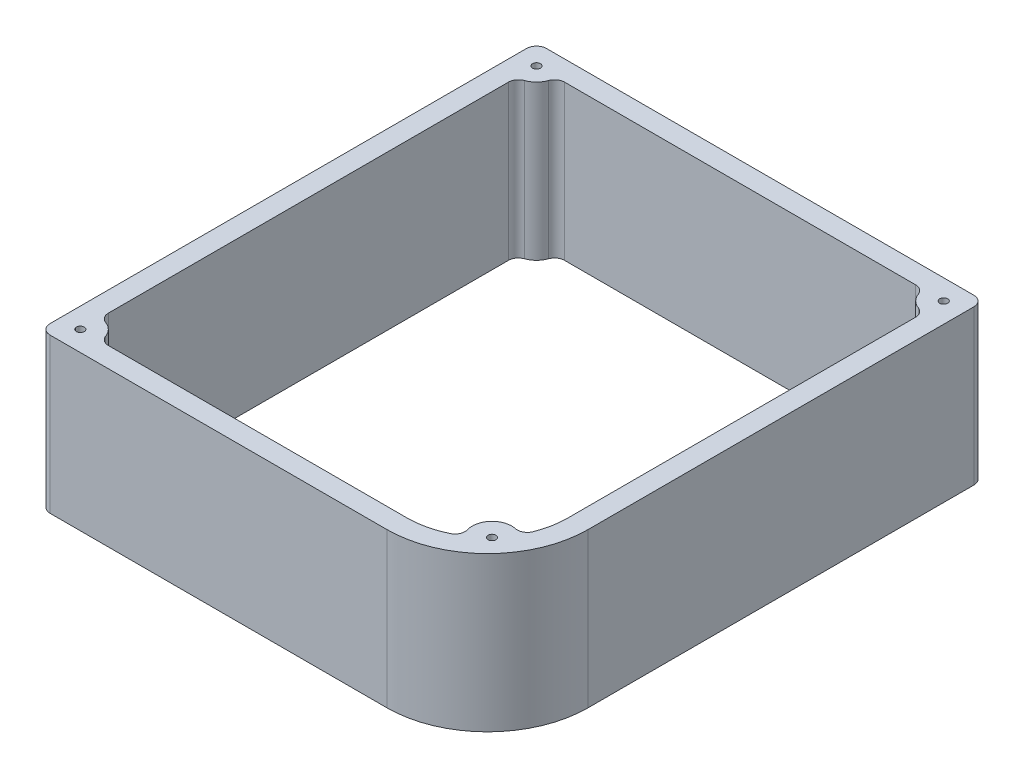
ISO-10303-21;
HEADER;
FILE_DESCRIPTION(('STEP AP214'),'2;1');
FILE_NAME('part.step','',(''),(''),'','','');
FILE_SCHEMA(('AUTOMOTIVE_DESIGN { 1 0 10303 214 1 1 1 1 }'));
ENDSEC;
DATA;
#1=APPLICATION_CONTEXT('core data for automotive mechanical design processes');
#2=APPLICATION_PROTOCOL_DEFINITION('international standard','automotive_design',2000,#1);
#3=PRODUCT_CONTEXT('',#1,'mechanical');
#4=PRODUCT('Part','Part','',(#3));
#5=PRODUCT_RELATED_PRODUCT_CATEGORY('part','',(#4));
#6=PRODUCT_DEFINITION_FORMATION('','',#4);
#7=PRODUCT_DEFINITION_CONTEXT('part definition',#1,'design');
#8=PRODUCT_DEFINITION('design','',#6,#7);
#9=PRODUCT_DEFINITION_SHAPE('','',#8);
#10=(LENGTH_UNIT() NAMED_UNIT(*) SI_UNIT(.MILLI.,.METRE.));
#11=(NAMED_UNIT(*) PLANE_ANGLE_UNIT() SI_UNIT($,.RADIAN.));
#12=(NAMED_UNIT(*) SI_UNIT($,.STERADIAN.) SOLID_ANGLE_UNIT());
#13=UNCERTAINTY_MEASURE_WITH_UNIT(LENGTH_MEASURE(1.E-05),#10,'distance_accuracy_value','');
#14=(GEOMETRIC_REPRESENTATION_CONTEXT(3) GLOBAL_UNCERTAINTY_ASSIGNED_CONTEXT((#13)) GLOBAL_UNIT_ASSIGNED_CONTEXT((#10,
#11,#12)) REPRESENTATION_CONTEXT('',''));
#15=CARTESIAN_POINT('',(0.,0.,0.));
#16=DIRECTION('',(0.,0.,1.));
#17=DIRECTION('',(1.,0.,0.));
#18=AXIS2_PLACEMENT_3D('',#15,#16,#17);
#19=CARTESIAN_POINT('',(22.8844907346791,39.,46.8900761871675));
#20=DIRECTION('',(0.,1.,0.));
#21=DIRECTION('',(0.,0.,1.));
#22=AXIS2_PLACEMENT_3D('',#19,#20,#21);
#23=PLANE('',#22);
#24=CARTESIAN_POINT('',(-59.6555092853209,39.,67.2100761871675));
#25=DIRECTION('',(0.,1.,0.));
#26=DIRECTION('',(0.,0.,1.));
#27=AXIS2_PLACEMENT_3D('',#24,#25,#26);
#28=CIRCLE('',#27,0.999999999999998);
#29=CARTESIAN_POINT('',(-59.6555092853209,39.,68.2100761871675));
#30=VERTEX_POINT('',#29);
#31=EDGE_CURVE('E455',#30,#30,#28,.T.);
#32=ORIENTED_EDGE('',*,*,#31,.F.);
#33=EDGE_LOOP('',(#32));
#34=FACE_BOUND('',#33,.T.);
#35=CARTESIAN_POINT('',(-59.6555092853209,39.,-48.0299778128325));
#36=DIRECTION('',(0.,1.,0.));
#37=DIRECTION('',(0.,0.,1.));
#38=AXIS2_PLACEMENT_3D('',#35,#36,#37);
#39=CIRCLE('',#38,0.999999999999998);
#40=CARTESIAN_POINT('',(-59.6555092853209,39.,-47.0299778128325));
#41=VERTEX_POINT('',#40);
#42=EDGE_CURVE('E250',#41,#41,#39,.T.);
#43=ORIENTED_EDGE('',*,*,#42,.F.);
#44=EDGE_LOOP('',(#43));
#45=FACE_BOUND('',#44,.T.);
#46=DIRECTION('',(0.,0.,1.));
#47=VECTOR('',#46,1.);
#48=CARTESIAN_POINT('',(-64.7355092853209,39.,-53.1099778128325));
#49=LINE('',#48,#47);
#50=CARTESIAN_POINT('',(-64.7355092853209,39.,-50.5699778128325));
#51=VERTEX_POINT('',#50);
#52=CARTESIAN_POINT('',(-64.7355092853209,39.,69.7500761871675));
#53=VERTEX_POINT('',#52);
#54=EDGE_CURVE('E283',#51,#53,#49,.T.);
#55=ORIENTED_EDGE('',*,*,#54,.T.);
#56=CARTESIAN_POINT('',(-62.1955092853209,39.,69.7500761871675));
#57=DIRECTION('',(0.,1.,0.));
#58=DIRECTION('',(0.,0.,1.));
#59=AXIS2_PLACEMENT_3D('',#56,#57,#58);
#60=CIRCLE('',#59,2.54);
#61=CARTESIAN_POINT('',(-62.1955092853209,39.,72.2900761871675));
#62=VERTEX_POINT('',#61);
#63=EDGE_CURVE('E325',#53,#62,#60,.T.);
#64=ORIENTED_EDGE('',*,*,#63,.T.);
#65=DIRECTION('',(1.,0.,0.));
#66=VECTOR('',#65,1.);
#67=CARTESIAN_POINT('',(22.8844907346791,39.,72.2900761871675));
#68=LINE('',#67,#66);
#69=CARTESIAN_POINT('',(22.8844907346791,39.,72.2900761871675));
#70=VERTEX_POINT('',#69);
#71=EDGE_CURVE('E286',#62,#70,#68,.T.);
#72=ORIENTED_EDGE('',*,*,#71,.T.);
#73=CARTESIAN_POINT('',(22.8844907346791,39.,46.8900761871675));
#74=DIRECTION('',(0.,1.,0.));
#75=DIRECTION('',(0.,0.,1.));
#76=AXIS2_PLACEMENT_3D('',#73,#74,#75);
#77=CIRCLE('',#76,25.4);
#78=CARTESIAN_POINT('',(48.2844907346791,39.,46.8900761871675));
#79=VERTEX_POINT('',#78);
#80=EDGE_CURVE('E288',#70,#79,#77,.T.);
#81=ORIENTED_EDGE('',*,*,#80,.T.);
#82=DIRECTION('',(0.,0.,-1.));
#83=VECTOR('',#82,1.);
#84=CARTESIAN_POINT('',(48.2844907346791,39.,-53.1099778128325));
#85=LINE('',#84,#83);
#86=CARTESIAN_POINT('',(48.2844907346791,39.,-50.5699778128325));
#87=VERTEX_POINT('',#86);
#88=EDGE_CURVE('E276',#79,#87,#85,.T.);
#89=ORIENTED_EDGE('',*,*,#88,.T.);
#90=CARTESIAN_POINT('',(45.7444907346791,39.,-50.5699778128325));
#91=DIRECTION('',(0.,1.,0.));
#92=DIRECTION('',(0.,0.,1.));
#93=AXIS2_PLACEMENT_3D('',#90,#91,#92);
#94=CIRCLE('',#93,2.54);
#95=CARTESIAN_POINT('',(45.7444907346791,39.,-53.1099778128325));
#96=VERTEX_POINT('',#95);
#97=EDGE_CURVE('E321',#87,#96,#94,.T.);
#98=ORIENTED_EDGE('',*,*,#97,.T.);
#99=DIRECTION('',(-1.,0.,0.));
#100=VECTOR('',#99,1.);
#101=CARTESIAN_POINT('',(48.2844907346791,39.,-53.1099778128325));
#102=LINE('',#101,#100);
#103=CARTESIAN_POINT('',(-62.1955092853209,39.,-53.1099778128325));
#104=VERTEX_POINT('',#103);
#105=EDGE_CURVE('E279',#96,#104,#102,.T.);
#106=ORIENTED_EDGE('',*,*,#105,.T.);
#107=CARTESIAN_POINT('',(-62.1955092853209,39.,-50.5699778128325));
#108=DIRECTION('',(0.,1.,0.));
#109=DIRECTION('',(0.,0.,1.));
#110=AXIS2_PLACEMENT_3D('',#107,#108,#109);
#111=CIRCLE('',#110,2.54);
#112=EDGE_CURVE('E323',#104,#51,#111,.T.);
#113=ORIENTED_EDGE('',*,*,#112,.T.);
#114=EDGE_LOOP('',(#55,#64,#72,#81,#89,#98,#106,#113));
#115=FACE_BOUND('',#114,.T.);
#116=CARTESIAN_POINT('',(37.8808925712128,39.,60.7484791239135));
#117=DIRECTION('',(0.,-1.,0.));
#118=DIRECTION('',(0.,0.,1.));
#119=AXIS2_PLACEMENT_3D('',#116,#117,#118);
#120=CIRCLE('',#119,5.);
#121=CARTESIAN_POINT('',(33.0857620181864,39.,62.165067624302));
#122=VERTEX_POINT('',#121);
#123=CARTESIAN_POINT('',(38.9154401298512,39.,55.8566787039336));
#124=VERTEX_POINT('',#123);
#125=EDGE_CURVE('E213',#122,#124,#120,.T.);
#126=ORIENTED_EDGE('',*,*,#125,.F.);
#127=CARTESIAN_POINT('',(30.649835697249,39.,62.8846945824994));
#128=DIRECTION('',(0.,1.,0.));
#129=DIRECTION('',(0.,0.,1.));
#130=AXIS2_PLACEMENT_3D('',#127,#128,#129);
#131=CIRCLE('',#130,2.54);
#132=CARTESIAN_POINT('',(31.7591706919018,39.,65.1696400675468));
#133=VERTEX_POINT('',#132);
#134=EDGE_CURVE('E382',#122,#133,#131,.F.);
#135=ORIENTED_EDGE('',*,*,#134,.T.);
#136=CARTESIAN_POINT('',(22.8844907346791,39.,46.8900761871675));
#137=DIRECTION('',(0.,1.,0.));
#138=DIRECTION('',(0.,0.,1.));
#139=AXIS2_PLACEMENT_3D('',#136,#137,#138);
#140=CIRCLE('',#139,20.32);
#141=CARTESIAN_POINT('',(22.8844907346791,39.,67.2100761871675));
#142=VERTEX_POINT('',#141);
#143=EDGE_CURVE('E273',#142,#133,#140,.T.);
#144=ORIENTED_EDGE('',*,*,#143,.F.);
#145=DIRECTION('',(1.,0.,0.));
#146=VECTOR('',#145,1.);
#147=CARTESIAN_POINT('',(22.8844907346791,39.,67.2100761871675));
#148=LINE('',#147,#146);
#149=CARTESIAN_POINT('',(-52.5562135456014,39.,67.2100761871675));
#150=VERTEX_POINT('',#149);
#151=EDGE_CURVE('E244',#150,#142,#148,.T.);
#152=ORIENTED_EDGE('',*,*,#151,.F.);
#153=CARTESIAN_POINT('',(-52.5562135456014,39.,64.6700761871675));
#154=DIRECTION('',(0.,1.,0.));
#155=DIRECTION('',(0.,0.,1.));
#156=AXIS2_PLACEMENT_3D('',#153,#154,#155);
#157=CIRCLE('',#156,2.54);
#158=CARTESIAN_POINT('',(-54.9477534897509,39.,65.5257260545415));
#159=VERTEX_POINT('',#158);
#160=EDGE_CURVE('E378',#150,#159,#157,.F.);
#161=ORIENTED_EDGE('',*,*,#160,.T.);
#162=CARTESIAN_POINT('',(-59.6555092853209,39.,67.2100761871675));
#163=DIRECTION('',(0.,-1.,0.));
#164=DIRECTION('',(0.,0.,1.));
#165=AXIS2_PLACEMENT_3D('',#162,#163,#164);
#166=CIRCLE('',#165,4.99999999999999);
#167=CARTESIAN_POINT('',(-57.9711591526949,39.,62.5023203915975));
#168=VERTEX_POINT('',#167);
#169=EDGE_CURVE('E241',#168,#159,#166,.T.);
#170=ORIENTED_EDGE('',*,*,#169,.F.);
#171=CARTESIAN_POINT('',(-57.1155092853209,39.,60.1107804474479));
#172=DIRECTION('',(0.,1.,0.));
#173=DIRECTION('',(0.,0.,1.));
#174=AXIS2_PLACEMENT_3D('',#171,#172,#173);
#175=CIRCLE('',#174,2.54);
#176=CARTESIAN_POINT('',(-59.6555092853209,39.,60.1107804474479));
#177=VERTEX_POINT('',#176);
#178=EDGE_CURVE('E374',#168,#177,#175,.F.);
#179=ORIENTED_EDGE('',*,*,#178,.T.);
#180=DIRECTION('',(0.,0.,1.));
#181=VECTOR('',#180,1.);
#182=CARTESIAN_POINT('',(-59.6555092853209,39.,-43.0299778128325));
#183=LINE('',#182,#181);
#184=CARTESIAN_POINT('',(-59.6555092853209,39.,-40.930682073113));
#185=VERTEX_POINT('',#184);
#186=EDGE_CURVE('E238',#185,#177,#183,.T.);
#187=ORIENTED_EDGE('',*,*,#186,.F.);
#188=CARTESIAN_POINT('',(-57.1155092853209,39.,-40.930682073113));
#189=DIRECTION('',(0.,1.,0.));
#190=DIRECTION('',(0.,0.,1.));
#191=AXIS2_PLACEMENT_3D('',#188,#189,#190);
#192=CIRCLE('',#191,2.54);
#193=CARTESIAN_POINT('',(-57.9711591526949,39.,-43.3222220172625));
#194=VERTEX_POINT('',#193);
#195=EDGE_CURVE('E11',#185,#194,#192,.F.);
#196=ORIENTED_EDGE('',*,*,#195,.T.);
#197=CARTESIAN_POINT('',(-59.6555092853209,39.,-48.0299778128325));
#198=DIRECTION('',(0.,-1.,0.));
#199=DIRECTION('',(0.,0.,1.));
#200=AXIS2_PLACEMENT_3D('',#197,#198,#199);
#201=CIRCLE('',#200,5.);
#202=CARTESIAN_POINT('',(-54.9477534897509,39.,-46.3456276802065));
#203=VERTEX_POINT('',#202);
#204=EDGE_CURVE('E235',#203,#194,#201,.T.);
#205=ORIENTED_EDGE('',*,*,#204,.F.);
#206=CARTESIAN_POINT('',(-52.5562135456014,39.,-45.4899778128325));
#207=DIRECTION('',(0.,1.,0.));
#208=DIRECTION('',(0.,0.,1.));
#209=AXIS2_PLACEMENT_3D('',#206,#207,#208);
#210=CIRCLE('',#209,2.54);
#211=CARTESIAN_POINT('',(-52.5562135456014,39.,-48.0299778128325));
#212=VERTEX_POINT('',#211);
#213=EDGE_CURVE('E397',#203,#212,#210,.F.);
#214=ORIENTED_EDGE('',*,*,#213,.T.);
#215=DIRECTION('',(-1.,0.,0.));
#216=VECTOR('',#215,1.);
#217=CARTESIAN_POINT('',(38.2044907346791,39.,-48.0299778128325));
#218=LINE('',#217,#216);
#219=CARTESIAN_POINT('',(36.1051949949596,39.,-48.0299778128325));
#220=VERTEX_POINT('',#219);
#221=EDGE_CURVE('E229',#220,#212,#218,.T.);
#222=ORIENTED_EDGE('',*,*,#221,.F.);
#223=CARTESIAN_POINT('',(36.1051949949596,39.,-45.4899778128325));
#224=DIRECTION('',(0.,1.,0.));
#225=DIRECTION('',(0.,0.,1.));
#226=AXIS2_PLACEMENT_3D('',#223,#224,#225);
#227=CIRCLE('',#226,2.54);
#228=CARTESIAN_POINT('',(38.4967349391091,39.,-46.3456276802065));
#229=VERTEX_POINT('',#228);
#230=EDGE_CURVE('E393',#220,#229,#227,.F.);
#231=ORIENTED_EDGE('',*,*,#230,.T.);
#232=CARTESIAN_POINT('',(43.2044907346791,39.,-48.0299778128325));
#233=DIRECTION('',(0.,-1.,0.));
#234=DIRECTION('',(0.,0.,1.));
#235=AXIS2_PLACEMENT_3D('',#232,#233,#234);
#236=CIRCLE('',#235,5.);
#237=CARTESIAN_POINT('',(41.5201406020531,39.,-43.3222220172625));
#238=VERTEX_POINT('',#237);
#239=EDGE_CURVE('E226',#238,#229,#236,.T.);
#240=ORIENTED_EDGE('',*,*,#239,.F.);
#241=CARTESIAN_POINT('',(40.6644907346791,39.,-40.930682073113));
#242=DIRECTION('',(0.,1.,0.));
#243=DIRECTION('',(0.,0.,1.));
#244=AXIS2_PLACEMENT_3D('',#241,#242,#243);
#245=CIRCLE('',#244,2.54);
#246=CARTESIAN_POINT('',(43.2044907346791,39.,-40.930682073113));
#247=VERTEX_POINT('',#246);
#248=EDGE_CURVE('E56',#238,#247,#245,.F.);
#249=ORIENTED_EDGE('',*,*,#248,.T.);
#250=DIRECTION('',(0.,0.,-1.));
#251=VECTOR('',#250,1.);
#252=CARTESIAN_POINT('',(43.2044907346791,39.,-43.0299778128325));
#253=LINE('',#252,#251);
#254=CARTESIAN_POINT('',(43.2044907346791,39.,46.8900761871675));
#255=VERTEX_POINT('',#254);
#256=EDGE_CURVE('E212',#255,#247,#253,.T.);
#257=ORIENTED_EDGE('',*,*,#256,.F.);
#258=CARTESIAN_POINT('',(22.8844907346791,39.,46.8900761871675));
#259=DIRECTION('',(0.,1.,0.));
#260=DIRECTION('',(0.,0.,1.));
#261=AXIS2_PLACEMENT_3D('',#258,#259,#260);
#262=CIRCLE('',#261,20.32);
#263=CARTESIAN_POINT('',(41.8062045117767,39.,54.2975823625004));
#264=VERTEX_POINT('',#263);
#265=EDGE_CURVE('E206',#264,#255,#262,.T.);
#266=ORIENTED_EDGE('',*,*,#265,.F.);
#267=CARTESIAN_POINT('',(39.4409902896395,39.,53.3716440905838));
#268=DIRECTION('',(0.,1.,0.));
#269=DIRECTION('',(0.,0.,1.));
#270=AXIS2_PLACEMENT_3D('',#267,#268,#269);
#271=CIRCLE('',#270,2.54);
#272=EDGE_CURVE('E386',#264,#124,#271,.F.);
#273=ORIENTED_EDGE('',*,*,#272,.T.);
#274=EDGE_LOOP('',(#126,#135,#144,#152,#161,#170,#179,#187,#196,#205,#214,#222,#231,#240,#249,
#257,#266,#273));
#275=FACE_BOUND('',#274,.T.);
#276=CARTESIAN_POINT('',(43.2044907346791,39.,-48.0299778128325));
#277=DIRECTION('',(0.,1.,0.));
#278=DIRECTION('',(0.,0.,1.));
#279=AXIS2_PLACEMENT_3D('',#276,#277,#278);
#280=CIRCLE('',#279,0.999999999999998);
#281=CARTESIAN_POINT('',(43.2044907346791,39.,-47.0299778128325));
#282=VERTEX_POINT('',#281);
#283=EDGE_CURVE('E449',#282,#282,#280,.T.);
#284=ORIENTED_EDGE('',*,*,#283,.F.);
#285=EDGE_LOOP('',(#284));
#286=FACE_BOUND('',#285,.T.);
#287=CARTESIAN_POINT('',(37.8808925712128,39.,60.7484791239135));
#288=DIRECTION('',(0.,1.,0.));
#289=DIRECTION('',(0.,0.,1.));
#290=AXIS2_PLACEMENT_3D('',#287,#288,#289);
#291=CIRCLE('',#290,0.999999999999998);
#292=CARTESIAN_POINT('',(37.8808925712128,39.,61.7484791239135));
#293=VERTEX_POINT('',#292);
#294=EDGE_CURVE('E461',#293,#293,#291,.T.);
#295=ORIENTED_EDGE('',*,*,#294,.F.);
#296=EDGE_LOOP('',(#295));
#297=FACE_BOUND('',#296,.T.);
#298=ADVANCED_FACE('F33',(#34,#45,#115,#275,#286,#297),#23,.T.);
#299=CARTESIAN_POINT('',(22.8844907346791,0.,46.8900761871675));
#300=DIRECTION('',(0.,1.,0.));
#301=DIRECTION('',(0.,0.,1.));
#302=AXIS2_PLACEMENT_3D('',#299,#300,#301);
#303=PLANE('',#302);
#304=CARTESIAN_POINT('',(-59.6555092853209,0.,67.2100761871675));
#305=DIRECTION('',(0.,1.,0.));
#306=DIRECTION('',(0.,0.,1.));
#307=AXIS2_PLACEMENT_3D('',#304,#305,#306);
#308=CIRCLE('',#307,0.999999999999998);
#309=CARTESIAN_POINT('',(-59.6555092853209,0.,68.2100761871675));
#310=VERTEX_POINT('',#309);
#311=EDGE_CURVE('E458',#310,#310,#308,.T.);
#312=ORIENTED_EDGE('',*,*,#311,.T.);
#313=EDGE_LOOP('',(#312));
#314=FACE_BOUND('',#313,.T.);
#315=CARTESIAN_POINT('',(-59.6555092853209,0.,-48.0299778128325));
#316=DIRECTION('',(0.,1.,0.));
#317=DIRECTION('',(0.,0.,1.));
#318=AXIS2_PLACEMENT_3D('',#315,#316,#317);
#319=CIRCLE('',#318,0.999999999999998);
#320=CARTESIAN_POINT('',(-59.6555092853209,0.,-47.0299778128325));
#321=VERTEX_POINT('',#320);
#322=EDGE_CURVE('E446',#321,#321,#319,.T.);
#323=ORIENTED_EDGE('',*,*,#322,.T.);
#324=EDGE_LOOP('',(#323));
#325=FACE_BOUND('',#324,.T.);
#326=DIRECTION('',(1.,0.,0.));
#327=VECTOR('',#326,1.);
#328=CARTESIAN_POINT('',(22.8844907346791,0.,72.2900761871675));
#329=LINE('',#328,#327);
#330=CARTESIAN_POINT('',(-62.1955092853209,0.,72.2900761871675));
#331=VERTEX_POINT('',#330);
#332=CARTESIAN_POINT('',(22.8844907346791,0.,72.2900761871675));
#333=VERTEX_POINT('',#332);
#334=EDGE_CURVE('E299',#331,#333,#329,.T.);
#335=ORIENTED_EDGE('',*,*,#334,.F.);
#336=CARTESIAN_POINT('',(-62.1955092853209,0.,69.7500761871675));
#337=DIRECTION('',(0.,1.,0.));
#338=DIRECTION('',(0.,0.,1.));
#339=AXIS2_PLACEMENT_3D('',#336,#337,#338);
#340=CIRCLE('',#339,2.54);
#341=CARTESIAN_POINT('',(-64.7355092853209,0.,69.7500761871675));
#342=VERTEX_POINT('',#341);
#343=EDGE_CURVE('E314',#331,#342,#340,.F.);
#344=ORIENTED_EDGE('',*,*,#343,.T.);
#345=DIRECTION('',(0.,0.,1.));
#346=VECTOR('',#345,1.);
#347=CARTESIAN_POINT('',(-64.7355092853209,0.,-53.1099778128325));
#348=LINE('',#347,#346);
#349=CARTESIAN_POINT('',(-64.7355092853209,0.,-50.5699778128325));
#350=VERTEX_POINT('',#349);
#351=EDGE_CURVE('E296',#350,#342,#348,.T.);
#352=ORIENTED_EDGE('',*,*,#351,.F.);
#353=CARTESIAN_POINT('',(-62.1955092853209,0.,-50.5699778128325));
#354=DIRECTION('',(0.,1.,0.));
#355=DIRECTION('',(0.,0.,1.));
#356=AXIS2_PLACEMENT_3D('',#353,#354,#355);
#357=CIRCLE('',#356,2.54);
#358=CARTESIAN_POINT('',(-62.1955092853209,0.,-53.1099778128325));
#359=VERTEX_POINT('',#358);
#360=EDGE_CURVE('E312',#350,#359,#357,.F.);
#361=ORIENTED_EDGE('',*,*,#360,.T.);
#362=DIRECTION('',(-1.,0.,0.));
#363=VECTOR('',#362,1.);
#364=CARTESIAN_POINT('',(48.2844907346791,0.,-53.1099778128325));
#365=LINE('',#364,#363);
#366=CARTESIAN_POINT('',(45.7444907346791,0.,-53.1099778128325));
#367=VERTEX_POINT('',#366);
#368=EDGE_CURVE('E293',#367,#359,#365,.T.);
#369=ORIENTED_EDGE('',*,*,#368,.F.);
#370=CARTESIAN_POINT('',(45.7444907346791,0.,-50.5699778128325));
#371=DIRECTION('',(0.,1.,0.));
#372=DIRECTION('',(0.,0.,1.));
#373=AXIS2_PLACEMENT_3D('',#370,#371,#372);
#374=CIRCLE('',#373,2.54);
#375=CARTESIAN_POINT('',(48.2844907346791,0.,-50.5699778128325));
#376=VERTEX_POINT('',#375);
#377=EDGE_CURVE('E310',#367,#376,#374,.F.);
#378=ORIENTED_EDGE('',*,*,#377,.T.);
#379=DIRECTION('',(0.,0.,-1.));
#380=VECTOR('',#379,1.);
#381=CARTESIAN_POINT('',(48.2844907346791,0.,-53.1099778128325));
#382=LINE('',#381,#380);
#383=CARTESIAN_POINT('',(48.2844907346791,0.,46.8900761871675));
#384=VERTEX_POINT('',#383);
#385=EDGE_CURVE('E221',#384,#376,#382,.T.);
#386=ORIENTED_EDGE('',*,*,#385,.F.);
#387=CARTESIAN_POINT('',(22.8844907346791,0.,46.8900761871675));
#388=DIRECTION('',(0.,1.,0.));
#389=DIRECTION('',(0.,0.,1.));
#390=AXIS2_PLACEMENT_3D('',#387,#388,#389);
#391=CIRCLE('',#390,25.4);
#392=EDGE_CURVE('E280',#333,#384,#391,.T.);
#393=ORIENTED_EDGE('',*,*,#392,.F.);
#394=EDGE_LOOP('',(#335,#344,#352,#361,#369,#378,#386,#393));
#395=FACE_BOUND('',#394,.T.);
#396=CARTESIAN_POINT('',(22.8844907346791,0.,46.8900761871675));
#397=DIRECTION('',(0.,1.,0.));
#398=DIRECTION('',(0.,0.,1.));
#399=AXIS2_PLACEMENT_3D('',#396,#397,#398);
#400=CIRCLE('',#399,20.32);
#401=CARTESIAN_POINT('',(22.8844907346791,0.,67.2100761871675));
#402=VERTEX_POINT('',#401);
#403=CARTESIAN_POINT('',(31.7591706919018,0.,65.1696400675468));
#404=VERTEX_POINT('',#403);
#405=EDGE_CURVE('E246',#402,#404,#400,.T.);
#406=ORIENTED_EDGE('',*,*,#405,.T.);
#407=CARTESIAN_POINT('',(30.649835697249,0.,62.8846945824994));
#408=DIRECTION('',(0.,1.,0.));
#409=DIRECTION('',(0.,0.,1.));
#410=AXIS2_PLACEMENT_3D('',#407,#408,#409);
#411=CIRCLE('',#410,2.54);
#412=CARTESIAN_POINT('',(33.0857620181864,0.,62.165067624302));
#413=VERTEX_POINT('',#412);
#414=EDGE_CURVE('E380',#404,#413,#411,.T.);
#415=ORIENTED_EDGE('',*,*,#414,.T.);
#416=CARTESIAN_POINT('',(37.8808925712128,0.,60.7484791239135));
#417=DIRECTION('',(0.,-1.,0.));
#418=DIRECTION('',(0.,0.,1.));
#419=AXIS2_PLACEMENT_3D('',#416,#417,#418);
#420=CIRCLE('',#419,5.);
#421=CARTESIAN_POINT('',(38.9154401298512,0.,55.8566787039336));
#422=VERTEX_POINT('',#421);
#423=EDGE_CURVE('E249',#413,#422,#420,.T.);
#424=ORIENTED_EDGE('',*,*,#423,.T.);
#425=CARTESIAN_POINT('',(39.4409902896395,0.,53.3716440905838));
#426=DIRECTION('',(0.,1.,0.));
#427=DIRECTION('',(0.,0.,1.));
#428=AXIS2_PLACEMENT_3D('',#425,#426,#427);
#429=CIRCLE('',#428,2.54);
#430=CARTESIAN_POINT('',(41.8062045117767,0.,54.2975823625004));
#431=VERTEX_POINT('',#430);
#432=EDGE_CURVE('E384',#422,#431,#429,.T.);
#433=ORIENTED_EDGE('',*,*,#432,.T.);
#434=CARTESIAN_POINT('',(22.8844907346791,0.,46.8900761871675));
#435=DIRECTION('',(0.,1.,0.));
#436=DIRECTION('',(0.,0.,1.));
#437=AXIS2_PLACEMENT_3D('',#434,#435,#436);
#438=CIRCLE('',#437,20.32);
#439=CARTESIAN_POINT('',(43.2044907346791,0.,46.8900761871675));
#440=VERTEX_POINT('',#439);
#441=EDGE_CURVE('E253',#431,#440,#438,.T.);
#442=ORIENTED_EDGE('',*,*,#441,.T.);
#443=DIRECTION('',(0.,0.,-1.));
#444=VECTOR('',#443,1.);
#445=CARTESIAN_POINT('',(43.2044907346791,0.,-43.0299778128325));
#446=LINE('',#445,#444);
#447=CARTESIAN_POINT('',(43.2044907346791,0.,-40.930682073113));
#448=VERTEX_POINT('',#447);
#449=EDGE_CURVE('E220',#440,#448,#446,.T.);
#450=ORIENTED_EDGE('',*,*,#449,.T.);
#451=CARTESIAN_POINT('',(40.6644907346791,0.,-40.930682073113));
#452=DIRECTION('',(0.,1.,0.));
#453=DIRECTION('',(0.,0.,1.));
#454=AXIS2_PLACEMENT_3D('',#451,#452,#453);
#455=CIRCLE('',#454,2.54);
#456=CARTESIAN_POINT('',(41.5201406020531,0.,-43.3222220172625));
#457=VERTEX_POINT('',#456);
#458=EDGE_CURVE('E388',#448,#457,#455,.T.);
#459=ORIENTED_EDGE('',*,*,#458,.T.);
#460=CARTESIAN_POINT('',(43.2044907346791,0.,-48.0299778128325));
#461=DIRECTION('',(0.,-1.,0.));
#462=DIRECTION('',(0.,0.,1.));
#463=AXIS2_PLACEMENT_3D('',#460,#461,#462);
#464=CIRCLE('',#463,5.);
#465=CARTESIAN_POINT('',(38.4967349391091,0.,-46.3456276802065));
#466=VERTEX_POINT('',#465);
#467=EDGE_CURVE('E256',#457,#466,#464,.T.);
#468=ORIENTED_EDGE('',*,*,#467,.T.);
#469=CARTESIAN_POINT('',(36.1051949949596,0.,-45.4899778128325));
#470=DIRECTION('',(0.,1.,0.));
#471=DIRECTION('',(0.,0.,1.));
#472=AXIS2_PLACEMENT_3D('',#469,#470,#471);
#473=CIRCLE('',#472,2.54);
#474=CARTESIAN_POINT('',(36.1051949949596,0.,-48.0299778128325));
#475=VERTEX_POINT('',#474);
#476=EDGE_CURVE('E391',#466,#475,#473,.T.);
#477=ORIENTED_EDGE('',*,*,#476,.T.);
#478=DIRECTION('',(-1.,0.,0.));
#479=VECTOR('',#478,1.);
#480=CARTESIAN_POINT('',(38.2044907346791,0.,-48.0299778128325));
#481=LINE('',#480,#479);
#482=CARTESIAN_POINT('',(-52.5562135456014,0.,-48.0299778128325));
#483=VERTEX_POINT('',#482);
#484=EDGE_CURVE('E259',#475,#483,#481,.T.);
#485=ORIENTED_EDGE('',*,*,#484,.T.);
#486=CARTESIAN_POINT('',(-52.5562135456014,0.,-45.4899778128325));
#487=DIRECTION('',(0.,1.,0.));
#488=DIRECTION('',(0.,0.,1.));
#489=AXIS2_PLACEMENT_3D('',#486,#487,#488);
#490=CIRCLE('',#489,2.54);
#491=CARTESIAN_POINT('',(-54.9477534897509,0.,-46.3456276802065));
#492=VERTEX_POINT('',#491);
#493=EDGE_CURVE('E395',#483,#492,#490,.T.);
#494=ORIENTED_EDGE('',*,*,#493,.T.);
#495=CARTESIAN_POINT('',(-59.6555092853209,0.,-48.0299778128325));
#496=DIRECTION('',(0.,-1.,0.));
#497=DIRECTION('',(0.,0.,1.));
#498=AXIS2_PLACEMENT_3D('',#495,#496,#497);
#499=CIRCLE('',#498,5.);
#500=CARTESIAN_POINT('',(-57.9711591526949,0.,-43.3222220172625));
#501=VERTEX_POINT('',#500);
#502=EDGE_CURVE('E262',#492,#501,#499,.T.);
#503=ORIENTED_EDGE('',*,*,#502,.T.);
#504=CARTESIAN_POINT('',(-57.1155092853209,0.,-40.930682073113));
#505=DIRECTION('',(0.,1.,0.));
#506=DIRECTION('',(0.,0.,1.));
#507=AXIS2_PLACEMENT_3D('',#504,#505,#506);
#508=CIRCLE('',#507,2.54);
#509=CARTESIAN_POINT('',(-59.6555092853209,0.,-40.930682073113));
#510=VERTEX_POINT('',#509);
#511=EDGE_CURVE('E41',#501,#510,#508,.T.);
#512=ORIENTED_EDGE('',*,*,#511,.T.);
#513=DIRECTION('',(0.,0.,1.));
#514=VECTOR('',#513,1.);
#515=CARTESIAN_POINT('',(-59.6555092853209,0.,-43.0299778128325));
#516=LINE('',#515,#514);
#517=CARTESIAN_POINT('',(-59.6555092853209,0.,60.1107804474479));
#518=VERTEX_POINT('',#517);
#519=EDGE_CURVE('E265',#510,#518,#516,.T.);
#520=ORIENTED_EDGE('',*,*,#519,.T.);
#521=CARTESIAN_POINT('',(-57.1155092853209,0.,60.1107804474479));
#522=DIRECTION('',(0.,1.,0.));
#523=DIRECTION('',(0.,0.,1.));
#524=AXIS2_PLACEMENT_3D('',#521,#522,#523);
#525=CIRCLE('',#524,2.54);
#526=CARTESIAN_POINT('',(-57.9711591526949,0.,62.5023203915975));
#527=VERTEX_POINT('',#526);
#528=EDGE_CURVE('E372',#518,#527,#525,.T.);
#529=ORIENTED_EDGE('',*,*,#528,.T.);
#530=CARTESIAN_POINT('',(-59.6555092853209,0.,67.2100761871675));
#531=DIRECTION('',(0.,-1.,0.));
#532=DIRECTION('',(0.,0.,1.));
#533=AXIS2_PLACEMENT_3D('',#530,#531,#532);
#534=CIRCLE('',#533,4.99999999999999);
#535=CARTESIAN_POINT('',(-54.9477534897509,0.,65.5257260545415));
#536=VERTEX_POINT('',#535);
#537=EDGE_CURVE('E268',#527,#536,#534,.T.);
#538=ORIENTED_EDGE('',*,*,#537,.T.);
#539=CARTESIAN_POINT('',(-52.5562135456014,0.,64.6700761871675));
#540=DIRECTION('',(0.,1.,0.));
#541=DIRECTION('',(0.,0.,1.));
#542=AXIS2_PLACEMENT_3D('',#539,#540,#541);
#543=CIRCLE('',#542,2.54);
#544=CARTESIAN_POINT('',(-52.5562135456014,0.,67.2100761871675));
#545=VERTEX_POINT('',#544);
#546=EDGE_CURVE('E376',#536,#545,#543,.T.);
#547=ORIENTED_EDGE('',*,*,#546,.T.);
#548=DIRECTION('',(1.,0.,0.));
#549=VECTOR('',#548,1.);
#550=CARTESIAN_POINT('',(22.8844907346791,0.,67.2100761871675));
#551=LINE('',#550,#549);
#552=EDGE_CURVE('E271',#545,#402,#551,.T.);
#553=ORIENTED_EDGE('',*,*,#552,.T.);
#554=EDGE_LOOP('',(#406,#415,#424,#433,#442,#450,#459,#468,#477,#485,#494,#503,#512,#520,#529,
#538,#547,#553));
#555=FACE_BOUND('',#554,.T.);
#556=CARTESIAN_POINT('',(43.2044907346791,0.,-48.0299778128325));
#557=DIRECTION('',(0.,1.,0.));
#558=DIRECTION('',(0.,0.,1.));
#559=AXIS2_PLACEMENT_3D('',#556,#557,#558);
#560=CIRCLE('',#559,0.999999999999998);
#561=CARTESIAN_POINT('',(43.2044907346791,0.,-47.0299778128325));
#562=VERTEX_POINT('',#561);
#563=EDGE_CURVE('E452',#562,#562,#560,.T.);
#564=ORIENTED_EDGE('',*,*,#563,.T.);
#565=EDGE_LOOP('',(#564));
#566=FACE_BOUND('',#565,.T.);
#567=CARTESIAN_POINT('',(37.8808925712128,0.,60.7484791239135));
#568=DIRECTION('',(0.,1.,0.));
#569=DIRECTION('',(0.,0.,1.));
#570=AXIS2_PLACEMENT_3D('',#567,#568,#569);
#571=CIRCLE('',#570,0.999999999999998);
#572=CARTESIAN_POINT('',(37.8808925712128,0.,61.7484791239135));
#573=VERTEX_POINT('',#572);
#574=EDGE_CURVE('E464',#573,#573,#571,.T.);
#575=ORIENTED_EDGE('',*,*,#574,.T.);
#576=EDGE_LOOP('',(#575));
#577=FACE_BOUND('',#576,.T.);
#578=ADVANCED_FACE('F400',(#314,#325,#395,#555,#566,#577),#303,.F.);
#579=CARTESIAN_POINT('',(48.2844907346791,39.,-53.1099778128325));
#580=DIRECTION('',(-1.,0.,0.));
#581=DIRECTION('',(0.,0.,1.));
#582=AXIS2_PLACEMENT_3D('',#579,#580,#581);
#583=PLANE('',#582);
#584=ORIENTED_EDGE('',*,*,#385,.T.);
#585=DIRECTION('',(0.,-1.,0.));
#586=VECTOR('',#585,1.);
#587=CARTESIAN_POINT('',(48.2844907346791,39.,-50.5699778128325));
#588=LINE('',#587,#586);
#589=EDGE_CURVE('E332',#376,#87,#588,.F.);
#590=ORIENTED_EDGE('',*,*,#589,.T.);
#591=ORIENTED_EDGE('',*,*,#88,.F.);
#592=DIRECTION('',(0.,-1.,0.));
#593=VECTOR('',#592,1.);
#594=CARTESIAN_POINT('',(48.2844907346791,39.,46.8900761871675));
#595=LINE('',#594,#593);
#596=EDGE_CURVE('E290',#79,#384,#595,.T.);
#597=ORIENTED_EDGE('',*,*,#596,.T.);
#598=EDGE_LOOP('',(#584,#590,#591,#597));
#599=FACE_BOUND('',#598,.T.);
#600=ADVANCED_FACE('F479',(#599),#583,.F.);
#601=CARTESIAN_POINT('',(48.2844907346791,39.,-53.1099778128325));
#602=DIRECTION('',(0.,0.,1.));
#603=DIRECTION('',(1.,0.,0.));
#604=AXIS2_PLACEMENT_3D('',#601,#602,#603);
#605=PLANE('',#604);
#606=ORIENTED_EDGE('',*,*,#368,.T.);
#607=DIRECTION('',(0.,-1.,0.));
#608=VECTOR('',#607,1.);
#609=CARTESIAN_POINT('',(-62.1955092853209,39.,-53.1099778128325));
#610=LINE('',#609,#608);
#611=EDGE_CURVE('E330',#359,#104,#610,.F.);
#612=ORIENTED_EDGE('',*,*,#611,.T.);
#613=ORIENTED_EDGE('',*,*,#105,.F.);
#614=DIRECTION('',(0.,-1.,0.));
#615=VECTOR('',#614,1.);
#616=CARTESIAN_POINT('',(45.7444907346791,39.,-53.1099778128325));
#617=LINE('',#616,#615);
#618=EDGE_CURVE('E327',#96,#367,#617,.T.);
#619=ORIENTED_EDGE('',*,*,#618,.T.);
#620=EDGE_LOOP('',(#606,#612,#613,#619));
#621=FACE_BOUND('',#620,.T.);
#622=ADVANCED_FACE('F499',(#621),#605,.F.);
#623=CARTESIAN_POINT('',(-64.7355092853209,39.,-53.1099778128325));
#624=DIRECTION('',(1.,0.,0.));
#625=DIRECTION('',(0.,0.,-1.));
#626=AXIS2_PLACEMENT_3D('',#623,#624,#625);
#627=PLANE('',#626);
#628=ORIENTED_EDGE('',*,*,#351,.T.);
#629=DIRECTION('',(0.,-1.,0.));
#630=VECTOR('',#629,1.);
#631=CARTESIAN_POINT('',(-64.7355092853209,39.,69.7500761871675));
#632=LINE('',#631,#630);
#633=EDGE_CURVE('E319',#342,#53,#632,.F.);
#634=ORIENTED_EDGE('',*,*,#633,.T.);
#635=ORIENTED_EDGE('',*,*,#54,.F.);
#636=DIRECTION('',(0.,-1.,0.));
#637=VECTOR('',#636,1.);
#638=CARTESIAN_POINT('',(-64.7355092853209,39.,-50.5699778128325));
#639=LINE('',#638,#637);
#640=EDGE_CURVE('E316',#51,#350,#639,.T.);
#641=ORIENTED_EDGE('',*,*,#640,.T.);
#642=EDGE_LOOP('',(#628,#634,#635,#641));
#643=FACE_BOUND('',#642,.T.);
#644=ADVANCED_FACE('F495',(#643),#627,.F.);
#645=CARTESIAN_POINT('',(22.8844907346791,39.,72.2900761871675));
#646=DIRECTION('',(0.,0.,-1.));
#647=DIRECTION('',(-1.,0.,0.));
#648=AXIS2_PLACEMENT_3D('',#645,#646,#647);
#649=PLANE('',#648);
#650=ORIENTED_EDGE('',*,*,#71,.F.);
#651=DIRECTION('',(0.,-1.,0.));
#652=VECTOR('',#651,1.);
#653=CARTESIAN_POINT('',(-62.1955092853209,39.,72.2900761871675));
#654=LINE('',#653,#652);
#655=EDGE_CURVE('E307',#62,#331,#654,.T.);
#656=ORIENTED_EDGE('',*,*,#655,.T.);
#657=ORIENTED_EDGE('',*,*,#334,.T.);
#658=DIRECTION('',(0.,-1.,0.));
#659=VECTOR('',#658,1.);
#660=CARTESIAN_POINT('',(22.8844907346791,39.,72.2900761871675));
#661=LINE('',#660,#659);
#662=EDGE_CURVE('E304',#70,#333,#661,.T.);
#663=ORIENTED_EDGE('',*,*,#662,.F.);
#664=EDGE_LOOP('',(#650,#656,#657,#663));
#665=FACE_BOUND('',#664,.T.);
#666=ADVANCED_FACE('F491',(#665),#649,.F.);
#667=CARTESIAN_POINT('',(22.8844907346791,39.,46.8900761871675));
#668=DIRECTION('',(0.,-1.,0.));
#669=DIRECTION('',(0.,0.,-1.));
#670=AXIS2_PLACEMENT_3D('',#667,#668,#669);
#671=CYLINDRICAL_SURFACE('',#670,25.4);
#672=ORIENTED_EDGE('',*,*,#392,.T.);
#673=ORIENTED_EDGE('',*,*,#596,.F.);
#674=ORIENTED_EDGE('',*,*,#80,.F.);
#675=ORIENTED_EDGE('',*,*,#662,.T.);
#676=EDGE_LOOP('',(#672,#673,#674,#675));
#677=FACE_BOUND('',#676,.T.);
#678=ADVANCED_FACE('F488',(#677),#671,.T.);
#679=CARTESIAN_POINT('',(22.8844907346791,39.,46.8900761871675));
#680=DIRECTION('',(0.,-1.,0.));
#681=DIRECTION('',(0.,0.,-1.));
#682=AXIS2_PLACEMENT_3D('',#679,#680,#681);
#683=CYLINDRICAL_SURFACE('',#682,20.32);
#684=ORIENTED_EDGE('',*,*,#143,.T.);
#685=DIRECTION('',(0.,-1.,0.));
#686=VECTOR('',#685,1.);
#687=CARTESIAN_POINT('',(31.7591706919018,39.,65.1696400675468));
#688=LINE('',#687,#686);
#689=EDGE_CURVE('E346',#133,#404,#688,.T.);
#690=ORIENTED_EDGE('',*,*,#689,.T.);
#691=ORIENTED_EDGE('',*,*,#405,.F.);
#692=DIRECTION('',(0.,-1.,0.));
#693=VECTOR('',#692,1.);
#694=CARTESIAN_POINT('',(22.8844907346791,39.,67.2100761871675));
#695=LINE('',#694,#693);
#696=EDGE_CURVE('E222',#142,#402,#695,.T.);
#697=ORIENTED_EDGE('',*,*,#696,.F.);
#698=EDGE_LOOP('',(#684,#690,#691,#697));
#699=FACE_BOUND('',#698,.T.);
#700=ADVANCED_FACE('F485',(#699),#683,.F.);
#701=CARTESIAN_POINT('',(37.8808925712128,39.,60.7484791239135));
#702=DIRECTION('',(0.,-1.,0.));
#703=DIRECTION('',(0.,0.,-1.));
#704=AXIS2_PLACEMENT_3D('',#701,#702,#703);
#705=CYLINDRICAL_SURFACE('',#704,5.);
#706=ORIENTED_EDGE('',*,*,#423,.F.);
#707=DIRECTION('',(0.,-1.,0.));
#708=VECTOR('',#707,1.);
#709=CARTESIAN_POINT('',(33.0857620181864,39.,62.165067624302));
#710=LINE('',#709,#708);
#711=EDGE_CURVE('E352',#413,#122,#710,.F.);
#712=ORIENTED_EDGE('',*,*,#711,.T.);
#713=ORIENTED_EDGE('',*,*,#125,.T.);
#714=DIRECTION('',(0.,-1.,0.));
#715=VECTOR('',#714,1.);
#716=CARTESIAN_POINT('',(38.9154401298512,39.,55.8566787039336));
#717=LINE('',#716,#715);
#718=EDGE_CURVE('E349',#124,#422,#717,.T.);
#719=ORIENTED_EDGE('',*,*,#718,.T.);
#720=EDGE_LOOP('',(#706,#712,#713,#719));
#721=FACE_BOUND('',#720,.T.);
#722=ADVANCED_FACE('F441',(#721),#705,.T.);
#723=CARTESIAN_POINT('',(22.8844907346791,39.,46.8900761871675));
#724=DIRECTION('',(0.,-1.,0.));
#725=DIRECTION('',(0.,0.,-1.));
#726=AXIS2_PLACEMENT_3D('',#723,#724,#725);
#727=CYLINDRICAL_SURFACE('',#726,20.32);
#728=ORIENTED_EDGE('',*,*,#441,.F.);
#729=DIRECTION('',(0.,-1.,0.));
#730=VECTOR('',#729,1.);
#731=CARTESIAN_POINT('',(41.8062045117767,39.,54.2975823625004));
#732=LINE('',#731,#730);
#733=EDGE_CURVE('E48',#431,#264,#732,.F.);
#734=ORIENTED_EDGE('',*,*,#733,.T.);
#735=ORIENTED_EDGE('',*,*,#265,.T.);
#736=DIRECTION('',(0.,-1.,0.));
#737=VECTOR('',#736,1.);
#738=CARTESIAN_POINT('',(43.2044907346791,39.,46.8900761871675));
#739=LINE('',#738,#737);
#740=EDGE_CURVE('E209',#255,#440,#739,.T.);
#741=ORIENTED_EDGE('',*,*,#740,.T.);
#742=EDGE_LOOP('',(#728,#734,#735,#741));
#743=FACE_BOUND('',#742,.T.);
#744=ADVANCED_FACE('F208',(#743),#727,.F.);
#745=CARTESIAN_POINT('',(43.2044907346791,39.,-43.0299778128325));
#746=DIRECTION('',(-1.,0.,0.));
#747=DIRECTION('',(0.,0.,1.));
#748=AXIS2_PLACEMENT_3D('',#745,#746,#747);
#749=PLANE('',#748);
#750=ORIENTED_EDGE('',*,*,#256,.T.);
#751=DIRECTION('',(0.,1.,0.));
#752=VECTOR('',#751,1.);
#753=CARTESIAN_POINT('',(43.2044907346791,0.,-40.930682073113));
#754=LINE('',#753,#752);
#755=EDGE_CURVE('E355',#247,#448,#754,.F.);
#756=ORIENTED_EDGE('',*,*,#755,.T.);
#757=ORIENTED_EDGE('',*,*,#449,.F.);
#758=ORIENTED_EDGE('',*,*,#740,.F.);
#759=EDGE_LOOP('',(#750,#756,#757,#758));
#760=FACE_BOUND('',#759,.T.);
#761=ADVANCED_FACE('F216',(#760),#749,.T.);
#762=CARTESIAN_POINT('',(43.2044907346791,39.,-48.0299778128325));
#763=DIRECTION('',(0.,-1.,0.));
#764=DIRECTION('',(0.,0.,-1.));
#765=AXIS2_PLACEMENT_3D('',#762,#763,#764);
#766=CYLINDRICAL_SURFACE('',#765,5.);
#767=ORIENTED_EDGE('',*,*,#467,.F.);
#768=DIRECTION('',(0.,-1.,0.));
#769=VECTOR('',#768,1.);
#770=CARTESIAN_POINT('',(41.5201406020531,39.,-43.3222220172625));
#771=LINE('',#770,#769);
#772=EDGE_CURVE('E360',#457,#238,#771,.F.);
#773=ORIENTED_EDGE('',*,*,#772,.T.);
#774=ORIENTED_EDGE('',*,*,#239,.T.);
#775=DIRECTION('',(0.,-1.,0.));
#776=VECTOR('',#775,1.);
#777=CARTESIAN_POINT('',(38.4967349391091,39.,-46.3456276802065));
#778=LINE('',#777,#776);
#779=EDGE_CURVE('E357',#229,#466,#778,.T.);
#780=ORIENTED_EDGE('',*,*,#779,.T.);
#781=EDGE_LOOP('',(#767,#773,#774,#780));
#782=FACE_BOUND('',#781,.T.);
#783=ADVANCED_FACE('F430',(#782),#766,.T.);
#784=CARTESIAN_POINT('',(38.2044907346791,39.,-48.0299778128325));
#785=DIRECTION('',(0.,0.,1.));
#786=DIRECTION('',(1.,0.,0.));
#787=AXIS2_PLACEMENT_3D('',#784,#785,#786);
#788=PLANE('',#787);
#789=ORIENTED_EDGE('',*,*,#484,.F.);
#790=DIRECTION('',(0.,1.,0.));
#791=VECTOR('',#790,1.);
#792=CARTESIAN_POINT('',(36.1051949949596,39.,-48.0299778128325));
#793=LINE('',#792,#791);
#794=EDGE_CURVE('E365',#475,#220,#793,.T.);
#795=ORIENTED_EDGE('',*,*,#794,.T.);
#796=ORIENTED_EDGE('',*,*,#221,.T.);
#797=DIRECTION('',(0.,1.,0.));
#798=VECTOR('',#797,1.);
#799=CARTESIAN_POINT('',(-52.5562135456014,0.,-48.0299778128325));
#800=LINE('',#799,#798);
#801=EDGE_CURVE('E362',#212,#483,#800,.F.);
#802=ORIENTED_EDGE('',*,*,#801,.T.);
#803=EDGE_LOOP('',(#789,#795,#796,#802));
#804=FACE_BOUND('',#803,.T.);
#805=ADVANCED_FACE('F423',(#804),#788,.T.);
#806=CARTESIAN_POINT('',(-59.6555092853209,39.,-48.0299778128325));
#807=DIRECTION('',(0.,-1.,0.));
#808=DIRECTION('',(0.,0.,-1.));
#809=AXIS2_PLACEMENT_3D('',#806,#807,#808);
#810=CYLINDRICAL_SURFACE('',#809,5.);
#811=ORIENTED_EDGE('',*,*,#502,.F.);
#812=DIRECTION('',(0.,-1.,0.));
#813=VECTOR('',#812,1.);
#814=CARTESIAN_POINT('',(-54.9477534897509,39.,-46.3456276802065));
#815=LINE('',#814,#813);
#816=EDGE_CURVE('E370',#492,#203,#815,.F.);
#817=ORIENTED_EDGE('',*,*,#816,.T.);
#818=ORIENTED_EDGE('',*,*,#204,.T.);
#819=DIRECTION('',(0.,-1.,0.));
#820=VECTOR('',#819,1.);
#821=CARTESIAN_POINT('',(-57.9711591526949,39.,-43.3222220172625));
#822=LINE('',#821,#820);
#823=EDGE_CURVE('E367',#194,#501,#822,.T.);
#824=ORIENTED_EDGE('',*,*,#823,.T.);
#825=EDGE_LOOP('',(#811,#817,#818,#824));
#826=FACE_BOUND('',#825,.T.);
#827=ADVANCED_FACE('F414',(#826),#810,.T.);
#828=CARTESIAN_POINT('',(-59.6555092853209,39.,-43.0299778128325));
#829=DIRECTION('',(1.,0.,0.));
#830=DIRECTION('',(0.,0.,-1.));
#831=AXIS2_PLACEMENT_3D('',#828,#829,#830);
#832=PLANE('',#831);
#833=ORIENTED_EDGE('',*,*,#186,.T.);
#834=DIRECTION('',(0.,1.,0.));
#835=VECTOR('',#834,1.);
#836=CARTESIAN_POINT('',(-59.6555092853209,0.,60.1107804474479));
#837=LINE('',#836,#835);
#838=EDGE_CURVE('E336',#177,#518,#837,.F.);
#839=ORIENTED_EDGE('',*,*,#838,.T.);
#840=ORIENTED_EDGE('',*,*,#519,.F.);
#841=DIRECTION('',(0.,1.,0.));
#842=VECTOR('',#841,1.);
#843=CARTESIAN_POINT('',(-59.6555092853209,39.,-40.930682073113));
#844=LINE('',#843,#842);
#845=EDGE_CURVE('E334',#510,#185,#844,.T.);
#846=ORIENTED_EDGE('',*,*,#845,.T.);
#847=EDGE_LOOP('',(#833,#839,#840,#846));
#848=FACE_BOUND('',#847,.T.);
#849=ADVANCED_FACE('F407',(#848),#832,.T.);
#850=CARTESIAN_POINT('',(-59.6555092853209,39.,67.2100761871675));
#851=DIRECTION('',(0.,-1.,0.));
#852=DIRECTION('',(0.,0.,-1.));
#853=AXIS2_PLACEMENT_3D('',#850,#851,#852);
#854=CYLINDRICAL_SURFACE('',#853,4.99999999999999);
#855=ORIENTED_EDGE('',*,*,#537,.F.);
#856=DIRECTION('',(0.,-1.,0.));
#857=VECTOR('',#856,1.);
#858=CARTESIAN_POINT('',(-57.9711591526949,39.,62.5023203915975));
#859=LINE('',#858,#857);
#860=EDGE_CURVE('E342',#527,#168,#859,.F.);
#861=ORIENTED_EDGE('',*,*,#860,.T.);
#862=ORIENTED_EDGE('',*,*,#169,.T.);
#863=DIRECTION('',(0.,-1.,0.));
#864=VECTOR('',#863,1.);
#865=CARTESIAN_POINT('',(-54.9477534897509,39.,65.5257260545415));
#866=LINE('',#865,#864);
#867=EDGE_CURVE('E339',#159,#536,#866,.T.);
#868=ORIENTED_EDGE('',*,*,#867,.T.);
#869=EDGE_LOOP('',(#855,#861,#862,#868));
#870=FACE_BOUND('',#869,.T.);
#871=ADVANCED_FACE('F613',(#870),#854,.T.);
#872=CARTESIAN_POINT('',(22.8844907346791,39.,67.2100761871675));
#873=DIRECTION('',(0.,0.,-1.));
#874=DIRECTION('',(-1.,0.,0.));
#875=AXIS2_PLACEMENT_3D('',#872,#873,#874);
#876=PLANE('',#875);
#877=ORIENTED_EDGE('',*,*,#552,.F.);
#878=DIRECTION('',(0.,1.,0.));
#879=VECTOR('',#878,1.);
#880=CARTESIAN_POINT('',(-52.5562135456014,39.,67.2100761871675));
#881=LINE('',#880,#879);
#882=EDGE_CURVE('E344',#545,#150,#881,.T.);
#883=ORIENTED_EDGE('',*,*,#882,.T.);
#884=ORIENTED_EDGE('',*,*,#151,.T.);
#885=ORIENTED_EDGE('',*,*,#696,.T.);
#886=EDGE_LOOP('',(#877,#883,#884,#885));
#887=FACE_BOUND('',#886,.T.);
#888=ADVANCED_FACE('F607',(#887),#876,.T.);
#889=CARTESIAN_POINT('',(-59.6555092853209,39.,-48.0299778128325));
#890=DIRECTION('',(0.,-1.,0.));
#891=DIRECTION('',(0.,0.,-1.));
#892=AXIS2_PLACEMENT_3D('',#889,#890,#891);
#893=CYLINDRICAL_SURFACE('',#892,0.999999999999998);
#894=ORIENTED_EDGE('',*,*,#42,.T.);
#895=EDGE_LOOP('',(#894));
#896=FACE_BOUND('',#895,.T.);
#897=ORIENTED_EDGE('',*,*,#322,.F.);
#898=EDGE_LOOP('',(#897));
#899=FACE_BOUND('',#898,.T.);
#900=ADVANCED_FACE('F612',(#896,#899),#893,.F.);
#901=CARTESIAN_POINT('',(43.2044907346791,39.,-48.0299778128325));
#902=DIRECTION('',(0.,-1.,0.));
#903=DIRECTION('',(0.,0.,-1.));
#904=AXIS2_PLACEMENT_3D('',#901,#902,#903);
#905=CYLINDRICAL_SURFACE('',#904,0.999999999999998);
#906=ORIENTED_EDGE('',*,*,#283,.T.);
#907=EDGE_LOOP('',(#906));
#908=FACE_BOUND('',#907,.T.);
#909=ORIENTED_EDGE('',*,*,#563,.F.);
#910=EDGE_LOOP('',(#909));
#911=FACE_BOUND('',#910,.T.);
#912=ADVANCED_FACE('F739',(#908,#911),#905,.F.);
#913=CARTESIAN_POINT('',(-59.6555092853209,39.,67.2100761871675));
#914=DIRECTION('',(0.,-1.,0.));
#915=DIRECTION('',(0.,0.,-1.));
#916=AXIS2_PLACEMENT_3D('',#913,#914,#915);
#917=CYLINDRICAL_SURFACE('',#916,0.999999999999998);
#918=ORIENTED_EDGE('',*,*,#31,.T.);
#919=EDGE_LOOP('',(#918));
#920=FACE_BOUND('',#919,.T.);
#921=ORIENTED_EDGE('',*,*,#311,.F.);
#922=EDGE_LOOP('',(#921));
#923=FACE_BOUND('',#922,.T.);
#924=ADVANCED_FACE('F730',(#920,#923),#917,.F.);
#925=CARTESIAN_POINT('',(37.8808925712128,39.,60.7484791239135));
#926=DIRECTION('',(0.,-1.,0.));
#927=DIRECTION('',(0.,0.,-1.));
#928=AXIS2_PLACEMENT_3D('',#925,#926,#927);
#929=CYLINDRICAL_SURFACE('',#928,0.999999999999998);
#930=ORIENTED_EDGE('',*,*,#294,.T.);
#931=EDGE_LOOP('',(#930));
#932=FACE_BOUND('',#931,.T.);
#933=ORIENTED_EDGE('',*,*,#574,.F.);
#934=EDGE_LOOP('',(#933));
#935=FACE_BOUND('',#934,.T.);
#936=ADVANCED_FACE('F470',(#932,#935),#929,.F.);
#937=CARTESIAN_POINT('',(-62.1955092853209,39.,69.7500761871675));
#938=DIRECTION('',(0.,-1.,0.));
#939=DIRECTION('',(0.,0.,-1.));
#940=AXIS2_PLACEMENT_3D('',#937,#938,#939);
#941=CYLINDRICAL_SURFACE('',#940,2.54);
#942=ORIENTED_EDGE('',*,*,#63,.F.);
#943=ORIENTED_EDGE('',*,*,#633,.F.);
#944=ORIENTED_EDGE('',*,*,#343,.F.);
#945=ORIENTED_EDGE('',*,*,#655,.F.);
#946=EDGE_LOOP('',(#942,#943,#944,#945));
#947=FACE_BOUND('',#946,.T.);
#948=ADVANCED_FACE('F507',(#947),#941,.T.);
#949=CARTESIAN_POINT('',(-62.1955092853209,39.,-50.5699778128325));
#950=DIRECTION('',(0.,-1.,0.));
#951=DIRECTION('',(0.,0.,-1.));
#952=AXIS2_PLACEMENT_3D('',#949,#950,#951);
#953=CYLINDRICAL_SURFACE('',#952,2.54);
#954=ORIENTED_EDGE('',*,*,#112,.F.);
#955=ORIENTED_EDGE('',*,*,#611,.F.);
#956=ORIENTED_EDGE('',*,*,#360,.F.);
#957=ORIENTED_EDGE('',*,*,#640,.F.);
#958=EDGE_LOOP('',(#954,#955,#956,#957));
#959=FACE_BOUND('',#958,.T.);
#960=ADVANCED_FACE('F510',(#959),#953,.T.);
#961=CARTESIAN_POINT('',(45.7444907346791,39.,-50.5699778128325));
#962=DIRECTION('',(0.,-1.,0.));
#963=DIRECTION('',(0.,0.,-1.));
#964=AXIS2_PLACEMENT_3D('',#961,#962,#963);
#965=CYLINDRICAL_SURFACE('',#964,2.54);
#966=ORIENTED_EDGE('',*,*,#97,.F.);
#967=ORIENTED_EDGE('',*,*,#589,.F.);
#968=ORIENTED_EDGE('',*,*,#377,.F.);
#969=ORIENTED_EDGE('',*,*,#618,.F.);
#970=EDGE_LOOP('',(#966,#967,#968,#969));
#971=FACE_BOUND('',#970,.T.);
#972=ADVANCED_FACE('F514',(#971),#965,.T.);
#973=CARTESIAN_POINT('',(-57.1155092853209,39.,60.1107804474479));
#974=DIRECTION('',(0.,-1.,0.));
#975=DIRECTION('',(0.,0.,-1.));
#976=AXIS2_PLACEMENT_3D('',#973,#974,#975);
#977=CYLINDRICAL_SURFACE('',#976,2.54);
#978=ORIENTED_EDGE('',*,*,#178,.F.);
#979=ORIENTED_EDGE('',*,*,#860,.F.);
#980=ORIENTED_EDGE('',*,*,#528,.F.);
#981=ORIENTED_EDGE('',*,*,#838,.F.);
#982=EDGE_LOOP('',(#978,#979,#980,#981));
#983=FACE_BOUND('',#982,.T.);
#984=ADVANCED_FACE('F518',(#983),#977,.F.);
#985=CARTESIAN_POINT('',(-52.5562135456014,39.,64.6700761871675));
#986=DIRECTION('',(0.,-1.,0.));
#987=DIRECTION('',(0.,0.,-1.));
#988=AXIS2_PLACEMENT_3D('',#985,#986,#987);
#989=CYLINDRICAL_SURFACE('',#988,2.54);
#990=ORIENTED_EDGE('',*,*,#160,.F.);
#991=ORIENTED_EDGE('',*,*,#882,.F.);
#992=ORIENTED_EDGE('',*,*,#546,.F.);
#993=ORIENTED_EDGE('',*,*,#867,.F.);
#994=EDGE_LOOP('',(#990,#991,#992,#993));
#995=FACE_BOUND('',#994,.T.);
#996=ADVANCED_FACE('F522',(#995),#989,.F.);
#997=CARTESIAN_POINT('',(30.649835697249,39.,62.8846945824994));
#998=DIRECTION('',(0.,-1.,0.));
#999=DIRECTION('',(0.,0.,-1.));
#1000=AXIS2_PLACEMENT_3D('',#997,#998,#999);
#1001=CYLINDRICAL_SURFACE('',#1000,2.54);
#1002=ORIENTED_EDGE('',*,*,#134,.F.);
#1003=ORIENTED_EDGE('',*,*,#711,.F.);
#1004=ORIENTED_EDGE('',*,*,#414,.F.);
#1005=ORIENTED_EDGE('',*,*,#689,.F.);
#1006=EDGE_LOOP('',(#1002,#1003,#1004,#1005));
#1007=FACE_BOUND('',#1006,.T.);
#1008=ADVANCED_FACE('F526',(#1007),#1001,.F.);
#1009=CARTESIAN_POINT('',(39.4409902896395,39.,53.3716440905838));
#1010=DIRECTION('',(0.,-1.,0.));
#1011=DIRECTION('',(0.,0.,-1.));
#1012=AXIS2_PLACEMENT_3D('',#1009,#1010,#1011);
#1013=CYLINDRICAL_SURFACE('',#1012,2.54);
#1014=ORIENTED_EDGE('',*,*,#272,.F.);
#1015=ORIENTED_EDGE('',*,*,#733,.F.);
#1016=ORIENTED_EDGE('',*,*,#432,.F.);
#1017=ORIENTED_EDGE('',*,*,#718,.F.);
#1018=EDGE_LOOP('',(#1014,#1015,#1016,#1017));
#1019=FACE_BOUND('',#1018,.T.);
#1020=ADVANCED_FACE('F435',(#1019),#1013,.F.);
#1021=CARTESIAN_POINT('',(40.6644907346791,39.,-40.930682073113));
#1022=DIRECTION('',(0.,-1.,0.));
#1023=DIRECTION('',(0.,0.,-1.));
#1024=AXIS2_PLACEMENT_3D('',#1021,#1022,#1023);
#1025=CYLINDRICAL_SURFACE('',#1024,2.54);
#1026=ORIENTED_EDGE('',*,*,#248,.F.);
#1027=ORIENTED_EDGE('',*,*,#772,.F.);
#1028=ORIENTED_EDGE('',*,*,#458,.F.);
#1029=ORIENTED_EDGE('',*,*,#755,.F.);
#1030=EDGE_LOOP('',(#1026,#1027,#1028,#1029));
#1031=FACE_BOUND('',#1030,.T.);
#1032=ADVANCED_FACE('F433',(#1031),#1025,.F.);
#1033=CARTESIAN_POINT('',(36.1051949949596,39.,-45.4899778128325));
#1034=DIRECTION('',(0.,-1.,0.));
#1035=DIRECTION('',(0.,0.,-1.));
#1036=AXIS2_PLACEMENT_3D('',#1033,#1034,#1035);
#1037=CYLINDRICAL_SURFACE('',#1036,2.54);
#1038=ORIENTED_EDGE('',*,*,#230,.F.);
#1039=ORIENTED_EDGE('',*,*,#794,.F.);
#1040=ORIENTED_EDGE('',*,*,#476,.F.);
#1041=ORIENTED_EDGE('',*,*,#779,.F.);
#1042=EDGE_LOOP('',(#1038,#1039,#1040,#1041));
#1043=FACE_BOUND('',#1042,.T.);
#1044=ADVANCED_FACE('F426',(#1043),#1037,.F.);
#1045=CARTESIAN_POINT('',(-52.5562135456014,39.,-45.4899778128325));
#1046=DIRECTION('',(0.,-1.,0.));
#1047=DIRECTION('',(0.,0.,-1.));
#1048=AXIS2_PLACEMENT_3D('',#1045,#1046,#1047);
#1049=CYLINDRICAL_SURFACE('',#1048,2.54);
#1050=ORIENTED_EDGE('',*,*,#213,.F.);
#1051=ORIENTED_EDGE('',*,*,#816,.F.);
#1052=ORIENTED_EDGE('',*,*,#493,.F.);
#1053=ORIENTED_EDGE('',*,*,#801,.F.);
#1054=EDGE_LOOP('',(#1050,#1051,#1052,#1053));
#1055=FACE_BOUND('',#1054,.T.);
#1056=ADVANCED_FACE('F417',(#1055),#1049,.F.);
#1057=CARTESIAN_POINT('',(-57.1155092853209,39.,-40.930682073113));
#1058=DIRECTION('',(0.,-1.,0.));
#1059=DIRECTION('',(0.,0.,-1.));
#1060=AXIS2_PLACEMENT_3D('',#1057,#1058,#1059);
#1061=CYLINDRICAL_SURFACE('',#1060,2.54);
#1062=ORIENTED_EDGE('',*,*,#195,.F.);
#1063=ORIENTED_EDGE('',*,*,#845,.F.);
#1064=ORIENTED_EDGE('',*,*,#511,.F.);
#1065=ORIENTED_EDGE('',*,*,#823,.F.);
#1066=EDGE_LOOP('',(#1062,#1063,#1064,#1065));
#1067=FACE_BOUND('',#1066,.T.);
#1068=ADVANCED_FACE('F35',(#1067),#1061,.F.);
#1069=CLOSED_SHELL('',(#298,#578,#600,#622,#644,#666,#678,#700,#722,#744,#761,#783,#805,#827,
#849,#871,#888,#900,#912,#924,#936,#948,#960,#972,#984,#996,#1008,#1020,#1032,#1044,#1056,#1068));
#1070=MANIFOLD_SOLID_BREP('B2',#1069);
#1071=ADVANCED_BREP_SHAPE_REPRESENTATION('',(#18,#1070),#14);
#1072=SHAPE_DEFINITION_REPRESENTATION(#9,#1071);
ENDSEC;
END-ISO-10303-21;
